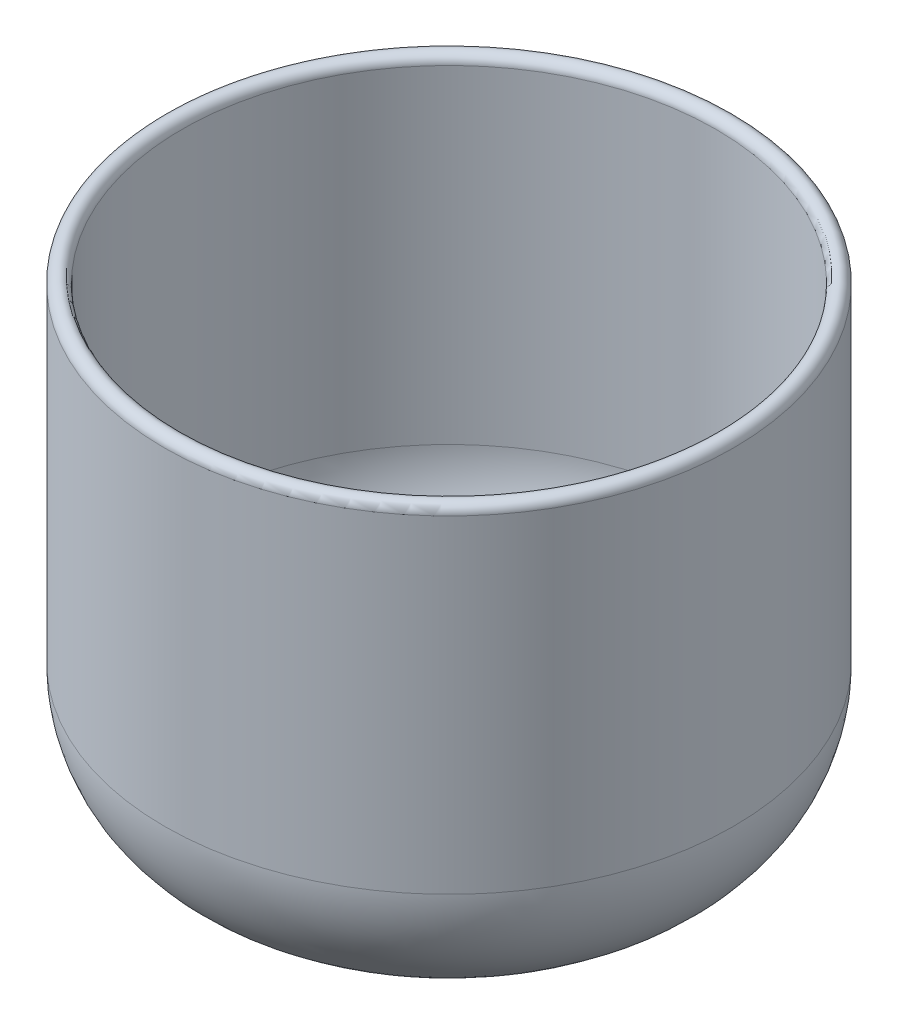
ISO-10303-21;
HEADER;
FILE_DESCRIPTION(('STEP AP214'),'2;1');
FILE_NAME('part.step','',(''),(''),'','','');
FILE_SCHEMA(('AUTOMOTIVE_DESIGN { 1 0 10303 214 1 1 1 1 }'));
ENDSEC;
DATA;
#1=APPLICATION_CONTEXT('core data for automotive mechanical design processes');
#2=APPLICATION_PROTOCOL_DEFINITION('international standard','automotive_design',2000,#1);
#3=PRODUCT_CONTEXT('',#1,'mechanical');
#4=PRODUCT('Part','Part','',(#3));
#5=PRODUCT_RELATED_PRODUCT_CATEGORY('part','',(#4));
#6=PRODUCT_DEFINITION_FORMATION('','',#4);
#7=PRODUCT_DEFINITION_CONTEXT('part definition',#1,'design');
#8=PRODUCT_DEFINITION('design','',#6,#7);
#9=PRODUCT_DEFINITION_SHAPE('','',#8);
#10=(LENGTH_UNIT() NAMED_UNIT(*) SI_UNIT(.MILLI.,.METRE.));
#11=(NAMED_UNIT(*) PLANE_ANGLE_UNIT() SI_UNIT($,.RADIAN.));
#12=(NAMED_UNIT(*) SI_UNIT($,.STERADIAN.) SOLID_ANGLE_UNIT());
#13=UNCERTAINTY_MEASURE_WITH_UNIT(LENGTH_MEASURE(1.E-05),#10,'distance_accuracy_value','');
#14=(GEOMETRIC_REPRESENTATION_CONTEXT(3) GLOBAL_UNCERTAINTY_ASSIGNED_CONTEXT((#13)) GLOBAL_UNIT_ASSIGNED_CONTEXT((#10,
#11,#12)) REPRESENTATION_CONTEXT('',''));
#15=CARTESIAN_POINT('',(0.,0.,0.));
#16=DIRECTION('',(0.,0.,1.));
#17=DIRECTION('',(1.,0.,0.));
#18=AXIS2_PLACEMENT_3D('',#15,#16,#17);
#19=CARTESIAN_POINT('',(0.,0.,0.));
#20=DIRECTION('',(0.,-1.,0.));
#21=DIRECTION('',(0.,0.,-1.));
#22=AXIS2_PLACEMENT_3D('',#19,#20,#21);
#23=PLANE('',#22);
#24=CARTESIAN_POINT('',(0.,0.,0.));
#25=DIRECTION('',(0.,-1.,0.));
#26=DIRECTION('',(0.,0.,-1.));
#27=AXIS2_PLACEMENT_3D('',#24,#25,#26);
#28=CIRCLE('',#27,12.7);
#29=CARTESIAN_POINT('',(0.,0.,-12.7));
#30=VERTEX_POINT('',#29);
#31=EDGE_CURVE('E10',#30,#30,#28,.T.);
#32=ORIENTED_EDGE('',*,*,#31,.T.);
#33=EDGE_LOOP('',(#32));
#34=FACE_BOUND('',#33,.T.);
#35=ADVANCED_FACE('F31',(#34),#23,.T.);
#36=CARTESIAN_POINT('',(0.,66.04,0.));
#37=DIRECTION('',(0.,-1.,0.));
#38=DIRECTION('',(0.,0.,-1.));
#39=AXIS2_PLACEMENT_3D('',#36,#37,#38);
#40=DEGENERATE_TOROIDAL_SURFACE('',#39,12.7,66.04,.T.);
#41=CARTESIAN_POINT('',(0.,1.08538142852788,0.));
#42=DIRECTION('',(0.,-1.,0.));
#43=DIRECTION('',(0.,0.,-1.));
#44=AXIS2_PLACEMENT_3D('',#41,#42,#43);
#45=CIRCLE('',#44,24.6238888888888);
#46=CARTESIAN_POINT('',(0.,1.08538142852788,-24.6238888888888));
#47=VERTEX_POINT('',#46);
#48=EDGE_CURVE('E37',#47,#47,#45,.T.);
#49=ORIENTED_EDGE('',*,*,#48,.T.);
#50=EDGE_LOOP('',(#49));
#51=FACE_BOUND('',#50,.T.);
#52=ORIENTED_EDGE('',*,*,#31,.F.);
#53=EDGE_LOOP('',(#52));
#54=FACE_BOUND('',#53,.T.);
#55=ADVANCED_FACE('F75',(#51,#54),#40,.T.);
#56=CARTESIAN_POINT('',(0.,21.0714179120578,0.));
#57=DIRECTION('',(0.,-1.,0.));
#58=DIRECTION('',(0.,0.,-1.));
#59=AXIS2_PLACEMENT_3D('',#56,#57,#58);
#60=TOROIDAL_SURFACE('',#59,20.955,20.32);
#61=CARTESIAN_POINT('',(0.,21.0714179120578,0.));
#62=DIRECTION('',(0.,-1.,0.));
#63=DIRECTION('',(0.,0.,-1.));
#64=AXIS2_PLACEMENT_3D('',#61,#62,#63);
#65=CIRCLE('',#64,41.275);
#66=CARTESIAN_POINT('',(0.,21.0714179120578,-41.275));
#67=VERTEX_POINT('',#66);
#68=EDGE_CURVE('E41',#67,#67,#65,.T.);
#69=ORIENTED_EDGE('',*,*,#68,.T.);
#70=EDGE_LOOP('',(#69));
#71=FACE_BOUND('',#70,.T.);
#72=ORIENTED_EDGE('',*,*,#48,.F.);
#73=EDGE_LOOP('',(#72));
#74=FACE_BOUND('',#73,.T.);
#75=ADVANCED_FACE('F79',(#71,#74),#60,.T.);
#76=CARTESIAN_POINT('',(0.,0.,0.));
#77=DIRECTION('',(0.,-1.,0.));
#78=DIRECTION('',(0.,0.,-1.));
#79=AXIS2_PLACEMENT_3D('',#76,#77,#78);
#80=CYLINDRICAL_SURFACE('',#79,41.275);
#81=CARTESIAN_POINT('',(0.,68.6026184035305,0.));
#82=DIRECTION('',(0.,-1.,0.));
#83=DIRECTION('',(0.,0.,-1.));
#84=AXIS2_PLACEMENT_3D('',#81,#82,#83);
#85=CIRCLE('',#84,41.275);
#86=CARTESIAN_POINT('',(0.,68.6026184035305,-41.275));
#87=VERTEX_POINT('',#86);
#88=EDGE_CURVE('E45',#87,#87,#85,.T.);
#89=ORIENTED_EDGE('',*,*,#88,.T.);
#90=EDGE_LOOP('',(#89));
#91=FACE_BOUND('',#90,.T.);
#92=ORIENTED_EDGE('',*,*,#68,.F.);
#93=EDGE_LOOP('',(#92));
#94=FACE_BOUND('',#93,.T.);
#95=ADVANCED_FACE('F83',(#91,#94),#80,.T.);
#96=CARTESIAN_POINT('',(0.,68.6292195887297,0.));
#97=DIRECTION('',(0.,-1.,0.));
#98=DIRECTION('',(0.,0.,-1.));
#99=AXIS2_PLACEMENT_3D('',#96,#97,#98);
#100=TOROIDAL_SURFACE('',#99,40.0051063848621,1.27017219967293);
#101=CARTESIAN_POINT('',(0.,68.6292195887297,0.));
#102=DIRECTION('',(0.,-1.,0.));
#103=DIRECTION('',(0.,0.,-1.));
#104=AXIS2_PLACEMENT_3D('',#101,#102,#103);
#105=CIRCLE('',#104,38.7349341851892);
#106=CARTESIAN_POINT('',(0.,68.6292195887297,-38.7349341851892));
#107=VERTEX_POINT('',#106);
#108=EDGE_CURVE('E50',#107,#107,#105,.T.);
#109=ORIENTED_EDGE('',*,*,#108,.T.);
#110=EDGE_LOOP('',(#109));
#111=FACE_BOUND('',#110,.T.);
#112=ORIENTED_EDGE('',*,*,#88,.F.);
#113=EDGE_LOOP('',(#112));
#114=FACE_BOUND('',#113,.T.);
#115=ADVANCED_FACE('F90',(#111,#114),#100,.T.);
#116=CARTESIAN_POINT('',(0.,0.,0.));
#117=DIRECTION('',(0.,-1.,0.));
#118=DIRECTION('',(0.,0.,-1.));
#119=AXIS2_PLACEMENT_3D('',#116,#117,#118);
#120=CYLINDRICAL_SURFACE('',#119,38.7349341851892);
#121=CARTESIAN_POINT('',(0.,21.0230405377974,0.));
#122=DIRECTION('',(0.,-1.,0.));
#123=DIRECTION('',(0.,0.,-1.));
#124=AXIS2_PLACEMENT_3D('',#121,#122,#123);
#125=CIRCLE('',#124,38.7349341851893);
#126=CARTESIAN_POINT('',(0.,21.0230405377974,-38.7349341851893));
#127=VERTEX_POINT('',#126);
#128=EDGE_CURVE('E53',#127,#127,#125,.T.);
#129=ORIENTED_EDGE('',*,*,#128,.T.);
#130=EDGE_LOOP('',(#129));
#131=FACE_BOUND('',#130,.T.);
#132=ORIENTED_EDGE('',*,*,#108,.F.);
#133=EDGE_LOOP('',(#132));
#134=FACE_BOUND('',#133,.T.);
#135=ADVANCED_FACE('F94',(#131,#134),#120,.F.);
#136=CARTESIAN_POINT('',(0.,21.0714179120578,0.));
#137=DIRECTION('',(0.,-1.,0.));
#138=DIRECTION('',(0.,0.,-1.));
#139=AXIS2_PLACEMENT_3D('',#136,#137,#138);
#140=TOROIDAL_SURFACE('',#139,20.955,17.78);
#141=CARTESIAN_POINT('',(0.,3.58363598896908,0.));
#142=DIRECTION('',(0.,-1.,0.));
#143=DIRECTION('',(0.,0.,-1.));
#144=AXIS2_PLACEMENT_3D('',#141,#142,#143);
#145=CIRCLE('',#144,24.1652777777778);
#146=CARTESIAN_POINT('',(0.,3.58363598896908,-24.1652777777778));
#147=VERTEX_POINT('',#146);
#148=EDGE_CURVE('E56',#147,#147,#145,.T.);
#149=ORIENTED_EDGE('',*,*,#148,.T.);
#150=EDGE_LOOP('',(#149));
#151=FACE_BOUND('',#150,.T.);
#152=ORIENTED_EDGE('',*,*,#128,.F.);
#153=EDGE_LOOP('',(#152));
#154=FACE_BOUND('',#153,.T.);
#155=ADVANCED_FACE('F72',(#151,#154),#140,.F.);
#156=CARTESIAN_POINT('',(0.,66.04,0.));
#157=DIRECTION('',(0.,-1.,0.));
#158=DIRECTION('',(0.,0.,-1.));
#159=AXIS2_PLACEMENT_3D('',#156,#157,#158);
#160=DEGENERATE_TOROIDAL_SURFACE('',#159,12.7,63.5,.T.);
#161=CARTESIAN_POINT('',(0.,2.54,0.));
#162=DIRECTION('',(0.,-1.,0.));
#163=DIRECTION('',(0.,0.,-1.));
#164=AXIS2_PLACEMENT_3D('',#161,#162,#163);
#165=CIRCLE('',#164,12.7);
#166=CARTESIAN_POINT('',(0.,2.54,-12.7));
#167=VERTEX_POINT('',#166);
#168=EDGE_CURVE('E59',#167,#167,#165,.T.);
#169=ORIENTED_EDGE('',*,*,#168,.T.);
#170=EDGE_LOOP('',(#169));
#171=FACE_BOUND('',#170,.T.);
#172=ORIENTED_EDGE('',*,*,#148,.F.);
#173=EDGE_LOOP('',(#172));
#174=FACE_BOUND('',#173,.T.);
#175=ADVANCED_FACE('F63',(#171,#174),#160,.F.);
#176=CARTESIAN_POINT('',(0.,2.54,0.));
#177=DIRECTION('',(0.,1.,0.));
#178=DIRECTION('',(0.,0.,1.));
#179=AXIS2_PLACEMENT_3D('',#176,#177,#178);
#180=PLANE('',#179);
#181=ORIENTED_EDGE('',*,*,#168,.F.);
#182=EDGE_LOOP('',(#181));
#183=FACE_BOUND('',#182,.T.);
#184=ADVANCED_FACE('F66',(#183),#180,.T.);
#185=CLOSED_SHELL('',(#35,#55,#75,#95,#115,#135,#155,#175,#184));
#186=MANIFOLD_SOLID_BREP('B2',#185);
#187=ADVANCED_BREP_SHAPE_REPRESENTATION('',(#18,#186),#14);
#188=SHAPE_DEFINITION_REPRESENTATION(#9,#187);
ENDSEC;
END-ISO-10303-21;
